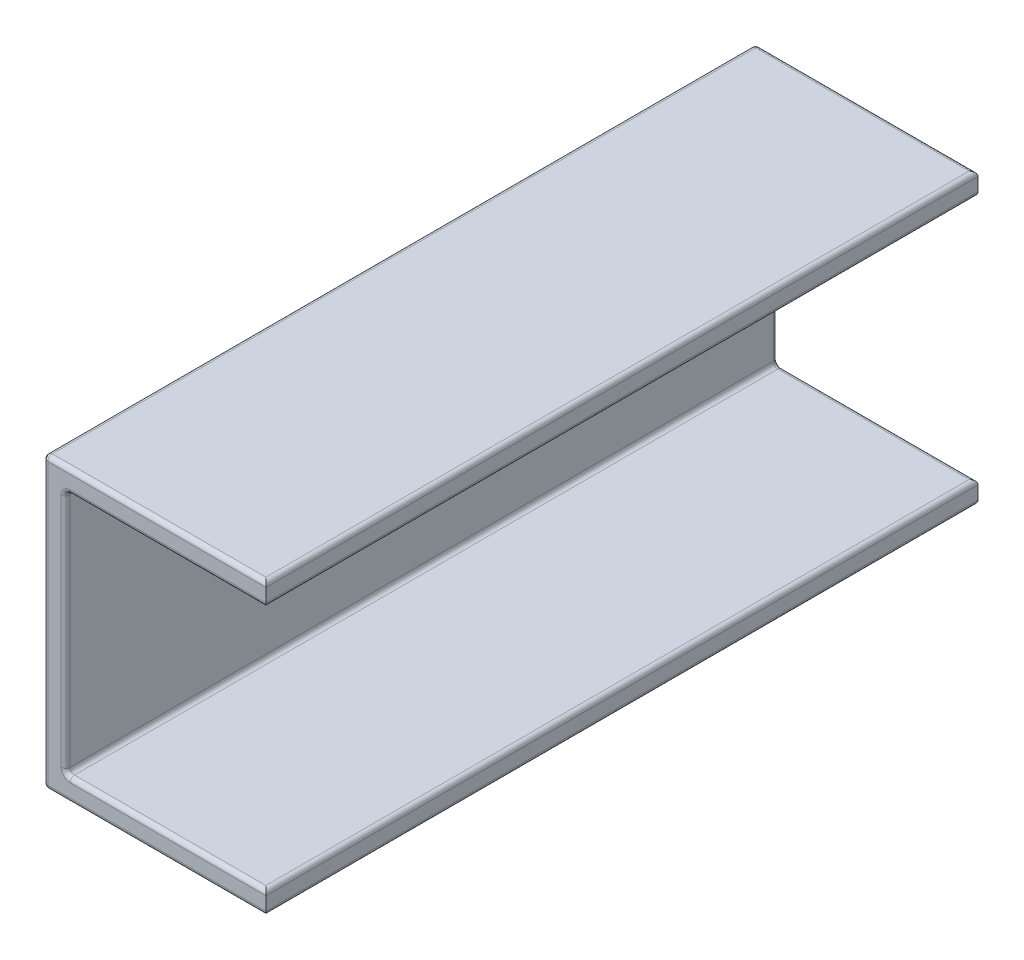
ISO-10303-21;
HEADER;
FILE_DESCRIPTION(('STEP AP214'),'2;1');
FILE_NAME('part.step','',(''),(''),'','','');
FILE_SCHEMA(('AUTOMOTIVE_DESIGN { 1 0 10303 214 1 1 1 1 }'));
ENDSEC;
DATA;
#1=APPLICATION_CONTEXT('core data for automotive mechanical design processes');
#2=APPLICATION_PROTOCOL_DEFINITION('international standard','automotive_design',2000,#1);
#3=PRODUCT_CONTEXT('',#1,'mechanical');
#4=PRODUCT('Part','Part','',(#3));
#5=PRODUCT_RELATED_PRODUCT_CATEGORY('part','',(#4));
#6=PRODUCT_DEFINITION_FORMATION('','',#4);
#7=PRODUCT_DEFINITION_CONTEXT('part definition',#1,'design');
#8=PRODUCT_DEFINITION('design','',#6,#7);
#9=PRODUCT_DEFINITION_SHAPE('','',#8);
#10=(LENGTH_UNIT() NAMED_UNIT(*) SI_UNIT(.MILLI.,.METRE.));
#11=(NAMED_UNIT(*) PLANE_ANGLE_UNIT() SI_UNIT($,.RADIAN.));
#12=(NAMED_UNIT(*) SI_UNIT($,.STERADIAN.) SOLID_ANGLE_UNIT());
#13=UNCERTAINTY_MEASURE_WITH_UNIT(LENGTH_MEASURE(1.E-05),#10,'distance_accuracy_value','');
#14=(GEOMETRIC_REPRESENTATION_CONTEXT(3) GLOBAL_UNCERTAINTY_ASSIGNED_CONTEXT((#13)) GLOBAL_UNIT_ASSIGNED_CONTEXT((#10,
#11,#12)) REPRESENTATION_CONTEXT('',''));
#15=CARTESIAN_POINT('',(0.,0.,0.));
#16=DIRECTION('',(0.,0.,1.));
#17=DIRECTION('',(1.,0.,0.));
#18=AXIS2_PLACEMENT_3D('',#15,#16,#17);
#19=CARTESIAN_POINT('',(-0.136666672173,0.05,0.));
#20=DIRECTION('',(1.,0.,0.));
#21=DIRECTION('',(0.,1.,0.));
#22=AXIS2_PLACEMENT_3D('',#19,#20,#21);
#23=PLANE('',#22);
#24=DIRECTION('',(0.,1.,0.));
#25=VECTOR('',#24,1.);
#26=CARTESIAN_POINT('',(-0.136666672173,0.05,1.59));
#27=LINE('',#26,#25);
#28=CARTESIAN_POINT('',(-0.136666672173,0.59,1.59));
#29=VERTEX_POINT('',#28);
#30=CARTESIAN_POINT('',(-0.136666672173,0.06,1.59));
#31=VERTEX_POINT('',#30);
#32=EDGE_CURVE('E234',#29,#31,#27,.F.);
#33=ORIENTED_EDGE('',*,*,#32,.T.);
#34=DIRECTION('',(0.,0.,1.));
#35=VECTOR('',#34,1.);
#36=CARTESIAN_POINT('',(-0.136666672173,0.06,0.));
#37=LINE('',#36,#35);
#38=CARTESIAN_POINT('',(-0.136666672173,0.06,0.01));
#39=VERTEX_POINT('',#38);
#40=EDGE_CURVE('E227',#31,#39,#37,.F.);
#41=ORIENTED_EDGE('',*,*,#40,.T.);
#42=DIRECTION('',(0.,1.,0.));
#43=VECTOR('',#42,1.);
#44=CARTESIAN_POINT('',(-0.136666672173,0.05,0.01));
#45=LINE('',#44,#43);
#46=CARTESIAN_POINT('',(-0.136666672173,0.59,0.01));
#47=VERTEX_POINT('',#46);
#48=EDGE_CURVE('E237',#39,#47,#45,.T.);
#49=ORIENTED_EDGE('',*,*,#48,.T.);
#50=DIRECTION('',(0.,0.,1.));
#51=VECTOR('',#50,1.);
#52=CARTESIAN_POINT('',(-0.136666672173,0.59,0.));
#53=LINE('',#52,#51);
#54=EDGE_CURVE('E207',#47,#29,#53,.T.);
#55=ORIENTED_EDGE('',*,*,#54,.T.);
#56=EDGE_LOOP('',(#33,#41,#49,#55));
#57=FACE_BOUND('',#56,.T.);
#58=ADVANCED_FACE('F17',(#57),#23,.T.);
#59=CARTESIAN_POINT('',(-0.126666672173,0.06,0.));
#60=DIRECTION('',(0.,0.,1.));
#61=DIRECTION('',(1.,0.,0.));
#62=AXIS2_PLACEMENT_3D('',#59,#60,#61);
#63=CYLINDRICAL_SURFACE('',#62,0.01);
#64=DIRECTION('',(0.,0.,1.));
#65=VECTOR('',#64,1.);
#66=CARTESIAN_POINT('',(-0.126666672173,0.0499999999999997,0.));
#67=LINE('',#66,#65);
#68=CARTESIAN_POINT('',(-0.126666672173,0.0499999999999998,0.01));
#69=VERTEX_POINT('',#68);
#70=CARTESIAN_POINT('',(-0.126666672173,0.0499999999999999,1.59));
#71=VERTEX_POINT('',#70);
#72=EDGE_CURVE('E194',#69,#71,#67,.T.);
#73=ORIENTED_EDGE('',*,*,#72,.F.);
#74=CARTESIAN_POINT('',(-0.126666672173,0.06,0.01));
#75=DIRECTION('',(0.,0.,1.));
#76=DIRECTION('',(1.,0.,0.));
#77=AXIS2_PLACEMENT_3D('',#74,#75,#76);
#78=CIRCLE('',#77,0.01);
#79=EDGE_CURVE('E222',#39,#69,#78,.T.);
#80=ORIENTED_EDGE('',*,*,#79,.F.);
#81=ORIENTED_EDGE('',*,*,#40,.F.);
#82=CARTESIAN_POINT('',(-0.126666672173,0.06,1.59));
#83=DIRECTION('',(0.,0.,1.));
#84=DIRECTION('',(1.,0.,0.));
#85=AXIS2_PLACEMENT_3D('',#82,#83,#84);
#86=CIRCLE('',#85,0.01);
#87=EDGE_CURVE('E213',#71,#31,#86,.F.);
#88=ORIENTED_EDGE('',*,*,#87,.F.);
#89=EDGE_LOOP('',(#73,#80,#81,#88));
#90=FACE_BOUND('',#89,.T.);
#91=ADVANCED_FACE('F633',(#90),#63,.F.);
#92=CARTESIAN_POINT('',(-0.126666672173,0.59,0.));
#93=DIRECTION('',(0.,0.,1.));
#94=DIRECTION('',(1.,0.,0.));
#95=AXIS2_PLACEMENT_3D('',#92,#93,#94);
#96=CYLINDRICAL_SURFACE('',#95,0.01);
#97=ORIENTED_EDGE('',*,*,#54,.F.);
#98=CARTESIAN_POINT('',(-0.126666672173,0.59,0.01));
#99=DIRECTION('',(0.,0.,1.));
#100=DIRECTION('',(1.,0.,0.));
#101=AXIS2_PLACEMENT_3D('',#98,#99,#100);
#102=CIRCLE('',#101,0.01);
#103=CARTESIAN_POINT('',(-0.126666672173,0.6,0.01));
#104=VERTEX_POINT('',#103);
#105=EDGE_CURVE('E210',#104,#47,#102,.T.);
#106=ORIENTED_EDGE('',*,*,#105,.F.);
#107=DIRECTION('',(0.,0.,1.));
#108=VECTOR('',#107,1.);
#109=CARTESIAN_POINT('',(-0.126666672173,0.6,0.));
#110=LINE('',#109,#108);
#111=CARTESIAN_POINT('',(-0.126666672173,0.6,1.59));
#112=VERTEX_POINT('',#111);
#113=EDGE_CURVE('E139',#112,#104,#110,.F.);
#114=ORIENTED_EDGE('',*,*,#113,.F.);
#115=CARTESIAN_POINT('',(-0.126666672173,0.59,1.59));
#116=DIRECTION('',(0.,0.,1.));
#117=DIRECTION('',(1.,0.,0.));
#118=AXIS2_PLACEMENT_3D('',#115,#116,#117);
#119=CIRCLE('',#118,0.01);
#120=EDGE_CURVE('E195',#29,#112,#119,.F.);
#121=ORIENTED_EDGE('',*,*,#120,.F.);
#122=EDGE_LOOP('',(#97,#106,#114,#121));
#123=FACE_BOUND('',#122,.T.);
#124=ADVANCED_FACE('F689',(#123),#96,.F.);
#125=CARTESIAN_POINT('',(0.313333327827,0.05,0.));
#126=DIRECTION('',(0.,1.,0.));
#127=DIRECTION('',(-1.,0.,0.));
#128=AXIS2_PLACEMENT_3D('',#125,#126,#127);
#129=PLANE('',#128);
#130=DIRECTION('',(-1.,0.,0.));
#131=VECTOR('',#130,1.);
#132=CARTESIAN_POINT('',(0.313333327827,0.05,1.59));
#133=LINE('',#132,#131);
#134=CARTESIAN_POINT('',(0.303333327827,0.05,1.59));
#135=VERTEX_POINT('',#134);
#136=EDGE_CURVE('E190',#71,#135,#133,.F.);
#137=ORIENTED_EDGE('',*,*,#136,.T.);
#138=DIRECTION('',(0.,0.,1.));
#139=VECTOR('',#138,1.);
#140=CARTESIAN_POINT('',(0.303333327827,0.05,0.));
#141=LINE('',#140,#139);
#142=CARTESIAN_POINT('',(0.303333327827,0.05,0.01));
#143=VERTEX_POINT('',#142);
#144=EDGE_CURVE('E138',#143,#135,#141,.T.);
#145=ORIENTED_EDGE('',*,*,#144,.F.);
#146=DIRECTION('',(-1.,0.,0.));
#147=VECTOR('',#146,1.);
#148=CARTESIAN_POINT('',(0.313333327827,0.05,0.01));
#149=LINE('',#148,#147);
#150=EDGE_CURVE('E134',#143,#69,#149,.T.);
#151=ORIENTED_EDGE('',*,*,#150,.T.);
#152=ORIENTED_EDGE('',*,*,#72,.T.);
#153=EDGE_LOOP('',(#137,#145,#151,#152));
#154=FACE_BOUND('',#153,.T.);
#155=ADVANCED_FACE('F636',(#154),#129,.T.);
#156=CARTESIAN_POINT('',(-0.136666672173,0.6,0.));
#157=DIRECTION('',(0.,-1.,0.));
#158=DIRECTION('',(1.,0.,0.));
#159=AXIS2_PLACEMENT_3D('',#156,#157,#158);
#160=PLANE('',#159);
#161=DIRECTION('',(1.,0.,0.));
#162=VECTOR('',#161,1.);
#163=CARTESIAN_POINT('',(-0.136666672173,0.6,1.59));
#164=LINE('',#163,#162);
#165=CARTESIAN_POINT('',(0.303333327827,0.6,1.59));
#166=VERTEX_POINT('',#165);
#167=EDGE_CURVE('E183',#166,#112,#164,.F.);
#168=ORIENTED_EDGE('',*,*,#167,.T.);
#169=ORIENTED_EDGE('',*,*,#113,.T.);
#170=DIRECTION('',(1.,0.,0.));
#171=VECTOR('',#170,1.);
#172=CARTESIAN_POINT('',(-0.136666672173,0.6,0.01));
#173=LINE('',#172,#171);
#174=CARTESIAN_POINT('',(0.303333327827,0.6,0.01));
#175=VERTEX_POINT('',#174);
#176=EDGE_CURVE('E186',#104,#175,#173,.T.);
#177=ORIENTED_EDGE('',*,*,#176,.T.);
#178=DIRECTION('',(0.,0.,1.));
#179=VECTOR('',#178,1.);
#180=CARTESIAN_POINT('',(0.303333327827,0.6,0.));
#181=LINE('',#180,#179);
#182=EDGE_CURVE('E178',#166,#175,#181,.F.);
#183=ORIENTED_EDGE('',*,*,#182,.F.);
#184=EDGE_LOOP('',(#168,#169,#177,#183));
#185=FACE_BOUND('',#184,.T.);
#186=ADVANCED_FACE('F691',(#185),#160,.T.);
#187=CARTESIAN_POINT('',(0.303333327827,0.04,0.));
#188=DIRECTION('',(0.,0.,1.));
#189=DIRECTION('',(1.,0.,0.));
#190=AXIS2_PLACEMENT_3D('',#187,#188,#189);
#191=CYLINDRICAL_SURFACE('',#190,0.01);
#192=ORIENTED_EDGE('',*,*,#144,.T.);
#193=CARTESIAN_POINT('',(0.303333327827,0.04,1.59));
#194=DIRECTION('',(-0.707106781186547,0.,0.707106781186547));
#195=DIRECTION('',(0.707106781186547,0.,0.707106781186547));
#196=AXIS2_PLACEMENT_3D('',#193,#194,#195);
#197=ELLIPSE('',#196,0.014142135623731,0.01);
#198=CARTESIAN_POINT('',(0.313333327827,0.04,1.6));
#199=VERTEX_POINT('',#198);
#200=EDGE_CURVE('E144',#135,#199,#197,.F.);
#201=ORIENTED_EDGE('',*,*,#200,.T.);
#202=DIRECTION('',(0.,0.,-1.));
#203=VECTOR('',#202,1.);
#204=CARTESIAN_POINT('',(0.313333327827,0.04,0.));
#205=LINE('',#204,#203);
#206=CARTESIAN_POINT('',(0.313333327827,0.04,0.));
#207=VERTEX_POINT('',#206);
#208=EDGE_CURVE('E141',#207,#199,#205,.F.);
#209=ORIENTED_EDGE('',*,*,#208,.F.);
#210=CARTESIAN_POINT('',(0.303333327827,0.04,0.01));
#211=DIRECTION('',(0.707106781186547,0.,0.707106781186547));
#212=DIRECTION('',(-0.707106781186547,0.,0.707106781186547));
#213=AXIS2_PLACEMENT_3D('',#210,#211,#212);
#214=ELLIPSE('',#213,0.014142135623731,0.01);
#215=EDGE_CURVE('E20',#207,#143,#214,.T.);
#216=ORIENTED_EDGE('',*,*,#215,.T.);
#217=EDGE_LOOP('',(#192,#201,#209,#216));
#218=FACE_BOUND('',#217,.T.);
#219=ADVANCED_FACE('F142',(#218),#191,.T.);
#220=CARTESIAN_POINT('',(0.303333327827,0.61,0.));
#221=DIRECTION('',(0.,0.,1.));
#222=DIRECTION('',(1.,0.,0.));
#223=AXIS2_PLACEMENT_3D('',#220,#221,#222);
#224=CYLINDRICAL_SURFACE('',#223,0.01);
#225=DIRECTION('',(0.,0.,1.));
#226=VECTOR('',#225,1.);
#227=CARTESIAN_POINT('',(0.313333327827,0.61,0.));
#228=LINE('',#227,#226);
#229=CARTESIAN_POINT('',(0.313333327827,0.61,1.6));
#230=VERTEX_POINT('',#229);
#231=CARTESIAN_POINT('',(0.313333327827,0.61,0.));
#232=VERTEX_POINT('',#231);
#233=EDGE_CURVE('E169',#230,#232,#228,.F.);
#234=ORIENTED_EDGE('',*,*,#233,.F.);
#235=CARTESIAN_POINT('',(0.303333327827,0.61,1.59));
#236=DIRECTION('',(-0.707106781186547,0.,0.707106781186547));
#237=DIRECTION('',(0.707106781186547,0.,0.707106781186547));
#238=AXIS2_PLACEMENT_3D('',#235,#236,#237);
#239=ELLIPSE('',#238,0.014142135623731,0.01);
#240=EDGE_CURVE('E149',#230,#166,#239,.F.);
#241=ORIENTED_EDGE('',*,*,#240,.T.);
#242=ORIENTED_EDGE('',*,*,#182,.T.);
#243=CARTESIAN_POINT('',(0.303333327827,0.61,0.01));
#244=DIRECTION('',(0.707106781186547,0.,0.707106781186547));
#245=DIRECTION('',(-0.707106781186547,0.,0.707106781186547));
#246=AXIS2_PLACEMENT_3D('',#243,#244,#245);
#247=ELLIPSE('',#246,0.014142135623731,0.01);
#248=EDGE_CURVE('E180',#175,#232,#247,.T.);
#249=ORIENTED_EDGE('',*,*,#248,.T.);
#250=EDGE_LOOP('',(#234,#241,#242,#249));
#251=FACE_BOUND('',#250,.T.);
#252=ADVANCED_FACE('F313',(#251),#224,.T.);
#253=CARTESIAN_POINT('',(0.313333327827,0.,0.));
#254=DIRECTION('',(1.,0.,0.));
#255=DIRECTION('',(0.,0.,-1.));
#256=AXIS2_PLACEMENT_3D('',#253,#254,#255);
#257=PLANE('',#256);
#258=DIRECTION('',(0.,0.,1.));
#259=VECTOR('',#258,1.);
#260=CARTESIAN_POINT('',(0.313333327827,0.01,0.));
#261=LINE('',#260,#259);
#262=CARTESIAN_POINT('',(0.313333327827,0.0100000000000001,0.));
#263=VERTEX_POINT('',#262);
#264=CARTESIAN_POINT('',(0.313333327827,0.0100000000000001,1.6));
#265=VERTEX_POINT('',#264);
#266=EDGE_CURVE('E167',#263,#265,#261,.T.);
#267=ORIENTED_EDGE('',*,*,#266,.F.);
#268=DIRECTION('',(0.,1.,0.));
#269=VECTOR('',#268,1.);
#270=CARTESIAN_POINT('',(0.313333327827,0.,0.));
#271=LINE('',#270,#269);
#272=EDGE_CURVE('E156',#263,#207,#271,.T.);
#273=ORIENTED_EDGE('',*,*,#272,.T.);
#274=ORIENTED_EDGE('',*,*,#208,.T.);
#275=DIRECTION('',(0.,1.,0.));
#276=VECTOR('',#275,1.);
#277=CARTESIAN_POINT('',(0.313333327827,0.,1.6));
#278=LINE('',#277,#276);
#279=EDGE_CURVE('E148',#199,#265,#278,.F.);
#280=ORIENTED_EDGE('',*,*,#279,.T.);
#281=EDGE_LOOP('',(#267,#273,#274,#280));
#282=FACE_BOUND('',#281,.T.);
#283=ADVANCED_FACE('F165',(#282),#257,.T.);
#284=CARTESIAN_POINT('',(0.313333327827,0.6,0.));
#285=DIRECTION('',(1.,0.,0.));
#286=DIRECTION('',(0.,1.,0.));
#287=AXIS2_PLACEMENT_3D('',#284,#285,#286);
#288=PLANE('',#287);
#289=DIRECTION('',(0.,0.,1.));
#290=VECTOR('',#289,1.);
#291=CARTESIAN_POINT('',(0.313333327827,0.64,0.));
#292=LINE('',#291,#290);
#293=CARTESIAN_POINT('',(0.313333327827,0.64,1.6));
#294=VERTEX_POINT('',#293);
#295=CARTESIAN_POINT('',(0.313333327827,0.64,0.));
#296=VERTEX_POINT('',#295);
#297=EDGE_CURVE('E299',#294,#296,#292,.F.);
#298=ORIENTED_EDGE('',*,*,#297,.F.);
#299=DIRECTION('',(0.,1.,0.));
#300=VECTOR('',#299,1.);
#301=CARTESIAN_POINT('',(0.313333327827,0.6,1.6));
#302=LINE('',#301,#300);
#303=EDGE_CURVE('E326',#294,#230,#302,.F.);
#304=ORIENTED_EDGE('',*,*,#303,.T.);
#305=ORIENTED_EDGE('',*,*,#233,.T.);
#306=DIRECTION('',(0.,1.,0.));
#307=VECTOR('',#306,1.);
#308=CARTESIAN_POINT('',(0.313333327827,0.6,0.));
#309=LINE('',#308,#307);
#310=EDGE_CURVE('E172',#232,#296,#309,.T.);
#311=ORIENTED_EDGE('',*,*,#310,.T.);
#312=EDGE_LOOP('',(#298,#304,#305,#311));
#313=FACE_BOUND('',#312,.T.);
#314=ADVANCED_FACE('F333',(#313),#288,.T.);
#315=CARTESIAN_POINT('',(0.153177077827,0.04,0.01));
#316=DIRECTION('',(-1.,0.,0.));
#317=DIRECTION('',(0.,-1.,0.));
#318=AXIS2_PLACEMENT_3D('',#315,#316,#317);
#319=CYLINDRICAL_SURFACE('',#318,0.01);
#320=ORIENTED_EDGE('',*,*,#150,.F.);
#321=ORIENTED_EDGE('',*,*,#215,.F.);
#322=DIRECTION('',(1.,0.,0.));
#323=VECTOR('',#322,1.);
#324=CARTESIAN_POINT('',(-0.006979172172787,0.04,0.));
#325=LINE('',#324,#323);
#326=CARTESIAN_POINT('',(-0.126666672173,0.04,0.));
#327=VERTEX_POINT('',#326);
#328=EDGE_CURVE('E131',#207,#327,#325,.F.);
#329=ORIENTED_EDGE('',*,*,#328,.T.);
#330=CARTESIAN_POINT('',(-0.126666672173,0.04,0.01));
#331=DIRECTION('',(1.,0.,0.));
#332=DIRECTION('',(0.,-1.,0.));
#333=AXIS2_PLACEMENT_3D('',#330,#331,#332);
#334=CIRCLE('',#333,0.01);
#335=EDGE_CURVE('E337',#69,#327,#334,.F.);
#336=ORIENTED_EDGE('',*,*,#335,.F.);
#337=EDGE_LOOP('',(#320,#321,#329,#336));
#338=FACE_BOUND('',#337,.T.);
#339=ADVANCED_FACE('F128',(#338),#319,.T.);
#340=CARTESIAN_POINT('',(-0.126666672173,0.06,0.01));
#341=DIRECTION('',(0.,0.,1.));
#342=DIRECTION('',(1.,0.,0.));
#343=AXIS2_PLACEMENT_3D('',#340,#341,#342);
#344=TOROIDAL_SURFACE('',#343,0.02,0.01);
#345=CARTESIAN_POINT('',(-0.126666672173,0.06,0.));
#346=DIRECTION('',(0.,0.,-1.));
#347=DIRECTION('',(0.,-1.,0.));
#348=AXIS2_PLACEMENT_3D('',#345,#346,#347);
#349=CIRCLE('',#348,0.02);
#350=CARTESIAN_POINT('',(-0.146666672173,0.06,0.));
#351=VERTEX_POINT('',#350);
#352=EDGE_CURVE('E160',#327,#351,#349,.T.);
#353=ORIENTED_EDGE('',*,*,#352,.T.);
#354=CARTESIAN_POINT('',(-0.146666672173,0.06,0.01));
#355=DIRECTION('',(0.,1.,0.));
#356=DIRECTION('',(-1.,0.,0.));
#357=AXIS2_PLACEMENT_3D('',#354,#355,#356);
#358=CIRCLE('',#357,0.01);
#359=EDGE_CURVE('E338',#39,#351,#358,.T.);
#360=ORIENTED_EDGE('',*,*,#359,.F.);
#361=ORIENTED_EDGE('',*,*,#79,.T.);
#362=ORIENTED_EDGE('',*,*,#335,.T.);
#363=EDGE_LOOP('',(#353,#360,#361,#362));
#364=FACE_BOUND('',#363,.T.);
#365=ADVANCED_FACE('F348',(#364),#344,.T.);
#366=CARTESIAN_POINT('',(-0.146666672173,0.1875,0.01));
#367=DIRECTION('',(0.,1.,0.));
#368=DIRECTION('',(-1.,0.,0.));
#369=AXIS2_PLACEMENT_3D('',#366,#367,#368);
#370=CYLINDRICAL_SURFACE('',#369,0.01);
#371=ORIENTED_EDGE('',*,*,#359,.T.);
#372=DIRECTION('',(0.,1.,0.));
#373=VECTOR('',#372,1.);
#374=CARTESIAN_POINT('',(-0.146666672173,0.325,0.));
#375=LINE('',#374,#373);
#376=CARTESIAN_POINT('',(-0.146666672173,0.59,0.));
#377=VERTEX_POINT('',#376);
#378=EDGE_CURVE('E471',#351,#377,#375,.T.);
#379=ORIENTED_EDGE('',*,*,#378,.T.);
#380=CARTESIAN_POINT('',(-0.146666672173,0.59,0.01));
#381=DIRECTION('',(0.,-1.,0.));
#382=DIRECTION('',(-1.,0.,0.));
#383=AXIS2_PLACEMENT_3D('',#380,#381,#382);
#384=CIRCLE('',#383,0.01);
#385=EDGE_CURVE('E368',#47,#377,#384,.F.);
#386=ORIENTED_EDGE('',*,*,#385,.F.);
#387=ORIENTED_EDGE('',*,*,#48,.F.);
#388=EDGE_LOOP('',(#371,#379,#386,#387));
#389=FACE_BOUND('',#388,.T.);
#390=ADVANCED_FACE('F358',(#389),#370,.T.);
#391=CARTESIAN_POINT('',(-0.126666672173,0.59,0.01));
#392=DIRECTION('',(0.,0.,1.));
#393=DIRECTION('',(1.,0.,0.));
#394=AXIS2_PLACEMENT_3D('',#391,#392,#393);
#395=TOROIDAL_SURFACE('',#394,0.02,0.01);
#396=CARTESIAN_POINT('',(-0.126666672173,0.59,0.));
#397=DIRECTION('',(0.,0.,-1.));
#398=DIRECTION('',(-1.,0.,0.));
#399=AXIS2_PLACEMENT_3D('',#396,#397,#398);
#400=CIRCLE('',#399,0.02);
#401=CARTESIAN_POINT('',(-0.126666672173,0.61,0.));
#402=VERTEX_POINT('',#401);
#403=EDGE_CURVE('E330',#377,#402,#400,.T.);
#404=ORIENTED_EDGE('',*,*,#403,.T.);
#405=CARTESIAN_POINT('',(-0.126666672173,0.61,0.01));
#406=DIRECTION('',(1.,0.,0.));
#407=DIRECTION('',(0.,1.,0.));
#408=AXIS2_PLACEMENT_3D('',#405,#406,#407);
#409=CIRCLE('',#408,0.01);
#410=EDGE_CURVE('E306',#104,#402,#409,.T.);
#411=ORIENTED_EDGE('',*,*,#410,.F.);
#412=ORIENTED_EDGE('',*,*,#105,.T.);
#413=ORIENTED_EDGE('',*,*,#385,.T.);
#414=EDGE_LOOP('',(#404,#411,#412,#413));
#415=FACE_BOUND('',#414,.T.);
#416=ADVANCED_FACE('F378',(#415),#395,.T.);
#417=CARTESIAN_POINT('',(-0.07182292217279,0.61,0.01));
#418=DIRECTION('',(1.,0.,0.));
#419=DIRECTION('',(0.,1.,0.));
#420=AXIS2_PLACEMENT_3D('',#417,#418,#419);
#421=CYLINDRICAL_SURFACE('',#420,0.01);
#422=DIRECTION('',(1.,0.,0.));
#423=VECTOR('',#422,1.);
#424=CARTESIAN_POINT('',(-0.006979172172787,0.61,0.));
#425=LINE('',#424,#423);
#426=EDGE_CURVE('E291',#402,#232,#425,.T.);
#427=ORIENTED_EDGE('',*,*,#426,.T.);
#428=ORIENTED_EDGE('',*,*,#248,.F.);
#429=ORIENTED_EDGE('',*,*,#176,.F.);
#430=ORIENTED_EDGE('',*,*,#410,.T.);
#431=EDGE_LOOP('',(#427,#428,#429,#430));
#432=FACE_BOUND('',#431,.T.);
#433=ADVANCED_FACE('F328',(#432),#421,.T.);
#434=CARTESIAN_POINT('',(-0.09682292217279,0.01,0.01));
#435=DIRECTION('',(1.,0.,0.));
#436=DIRECTION('',(0.,1.,0.));
#437=AXIS2_PLACEMENT_3D('',#434,#435,#436);
#438=CYLINDRICAL_SURFACE('',#437,0.01);
#439=DIRECTION('',(1.,0.,0.));
#440=VECTOR('',#439,1.);
#441=CARTESIAN_POINT('',(-0.006979172172787,0.01,0.));
#442=LINE('',#441,#440);
#443=CARTESIAN_POINT('',(-0.176666672173,0.00999999999999999,0.));
#444=VERTEX_POINT('',#443);
#445=EDGE_CURVE('E162',#444,#263,#442,.T.);
#446=ORIENTED_EDGE('',*,*,#445,.T.);
#447=CARTESIAN_POINT('',(0.303333327827,0.0100000000000001,0.01));
#448=DIRECTION('',(0.707106781186547,0.,0.707106781186547));
#449=DIRECTION('',(-0.707106781186547,0.,0.707106781186547));
#450=AXIS2_PLACEMENT_3D('',#447,#448,#449);
#451=ELLIPSE('',#450,0.014142135623731,0.01);
#452=CARTESIAN_POINT('',(0.303333327827,0.,0.01));
#453=VERTEX_POINT('',#452);
#454=EDGE_CURVE('E304',#453,#263,#451,.T.);
#455=ORIENTED_EDGE('',*,*,#454,.F.);
#456=DIRECTION('',(1.,0.,0.));
#457=VECTOR('',#456,1.);
#458=CARTESIAN_POINT('',(-0.186666672173,0.,0.01));
#459=LINE('',#458,#457);
#460=CARTESIAN_POINT('',(-0.176666672173,0.,0.01));
#461=VERTEX_POINT('',#460);
#462=EDGE_CURVE('E290',#461,#453,#459,.T.);
#463=ORIENTED_EDGE('',*,*,#462,.F.);
#464=CARTESIAN_POINT('',(-0.176666672173,0.00999999999999996,0.01));
#465=DIRECTION('',(1.,0.,0.));
#466=DIRECTION('',(0.,1.,0.));
#467=AXIS2_PLACEMENT_3D('',#464,#465,#466);
#468=CIRCLE('',#467,0.01);
#469=EDGE_CURVE('E287',#444,#461,#468,.F.);
#470=ORIENTED_EDGE('',*,*,#469,.F.);
#471=EDGE_LOOP('',(#446,#455,#463,#470));
#472=FACE_BOUND('',#471,.T.);
#473=ADVANCED_FACE('F797',(#472),#438,.T.);
#474=CARTESIAN_POINT('',(0.303333327827,0.01,0.));
#475=DIRECTION('',(0.,0.,1.));
#476=DIRECTION('',(1.,0.,0.));
#477=AXIS2_PLACEMENT_3D('',#474,#475,#476);
#478=CYLINDRICAL_SURFACE('',#477,0.01);
#479=ORIENTED_EDGE('',*,*,#266,.T.);
#480=CARTESIAN_POINT('',(0.303333327827,0.0100000000000001,1.59));
#481=DIRECTION('',(0.707106781186547,0.,-0.707106781186547));
#482=DIRECTION('',(0.707106781186547,0.,0.707106781186547));
#483=AXIS2_PLACEMENT_3D('',#480,#481,#482);
#484=ELLIPSE('',#483,0.014142135623731,0.01);
#485=CARTESIAN_POINT('',(0.303333327827,0.,1.59));
#486=VERTEX_POINT('',#485);
#487=EDGE_CURVE('E300',#486,#265,#484,.F.);
#488=ORIENTED_EDGE('',*,*,#487,.F.);
#489=DIRECTION('',(0.,0.,1.));
#490=VECTOR('',#489,1.);
#491=CARTESIAN_POINT('',(0.303333327827,0.,0.));
#492=LINE('',#491,#490);
#493=EDGE_CURVE('E395',#453,#486,#492,.T.);
#494=ORIENTED_EDGE('',*,*,#493,.F.);
#495=ORIENTED_EDGE('',*,*,#454,.T.);
#496=EDGE_LOOP('',(#479,#488,#494,#495));
#497=FACE_BOUND('',#496,.T.);
#498=ADVANCED_FACE('F805',(#497),#478,.T.);
#499=CARTESIAN_POINT('',(-0.07182292217279,0.61,1.59));
#500=DIRECTION('',(1.,0.,0.));
#501=DIRECTION('',(0.,1.,0.));
#502=AXIS2_PLACEMENT_3D('',#499,#500,#501);
#503=CYLINDRICAL_SURFACE('',#502,0.01);
#504=ORIENTED_EDGE('',*,*,#167,.F.);
#505=ORIENTED_EDGE('',*,*,#240,.F.);
#506=DIRECTION('',(1.,0.,0.));
#507=VECTOR('',#506,1.);
#508=CARTESIAN_POINT('',(-0.006979172172787,0.61,1.6));
#509=LINE('',#508,#507);
#510=CARTESIAN_POINT('',(-0.126666672173,0.61,1.6));
#511=VERTEX_POINT('',#510);
#512=EDGE_CURVE('E285',#511,#230,#509,.T.);
#513=ORIENTED_EDGE('',*,*,#512,.F.);
#514=CARTESIAN_POINT('',(-0.126666672173,0.61,1.59));
#515=DIRECTION('',(1.,0.,0.));
#516=DIRECTION('',(0.,1.,0.));
#517=AXIS2_PLACEMENT_3D('',#514,#515,#516);
#518=CIRCLE('',#517,0.01);
#519=EDGE_CURVE('E435',#112,#511,#518,.F.);
#520=ORIENTED_EDGE('',*,*,#519,.F.);
#521=EDGE_LOOP('',(#504,#505,#513,#520));
#522=FACE_BOUND('',#521,.T.);
#523=ADVANCED_FACE('F687',(#522),#503,.T.);
#524=CARTESIAN_POINT('',(-0.09682292217279,0.01,1.59));
#525=DIRECTION('',(1.,0.,0.));
#526=DIRECTION('',(0.,1.,0.));
#527=AXIS2_PLACEMENT_3D('',#524,#525,#526);
#528=CYLINDRICAL_SURFACE('',#527,0.01);
#529=DIRECTION('',(1.,0.,0.));
#530=VECTOR('',#529,1.);
#531=CARTESIAN_POINT('',(-0.186666672173,0.,1.59));
#532=LINE('',#531,#530);
#533=CARTESIAN_POINT('',(-0.176666672173,0.,1.59));
#534=VERTEX_POINT('',#533);
#535=EDGE_CURVE('E286',#486,#534,#532,.F.);
#536=ORIENTED_EDGE('',*,*,#535,.F.);
#537=ORIENTED_EDGE('',*,*,#487,.T.);
#538=DIRECTION('',(1.,0.,0.));
#539=VECTOR('',#538,1.);
#540=CARTESIAN_POINT('',(-0.006979172172787,0.01,1.6));
#541=LINE('',#540,#539);
#542=CARTESIAN_POINT('',(-0.176666672173,0.00999999999999999,1.6));
#543=VERTEX_POINT('',#542);
#544=EDGE_CURVE('E515',#543,#265,#541,.T.);
#545=ORIENTED_EDGE('',*,*,#544,.F.);
#546=CARTESIAN_POINT('',(-0.176666672173,0.00999999999999996,1.59));
#547=DIRECTION('',(1.,0.,0.));
#548=DIRECTION('',(0.,1.,0.));
#549=AXIS2_PLACEMENT_3D('',#546,#547,#548);
#550=CIRCLE('',#549,0.01);
#551=EDGE_CURVE('E282',#534,#543,#550,.F.);
#552=ORIENTED_EDGE('',*,*,#551,.F.);
#553=EDGE_LOOP('',(#536,#537,#545,#552));
#554=FACE_BOUND('',#553,.T.);
#555=ADVANCED_FACE('F823',(#554),#528,.T.);
#556=CARTESIAN_POINT('',(0.153177077827,0.04,1.59));
#557=DIRECTION('',(-1.,0.,0.));
#558=DIRECTION('',(0.,-1.,0.));
#559=AXIS2_PLACEMENT_3D('',#556,#557,#558);
#560=CYLINDRICAL_SURFACE('',#559,0.01);
#561=DIRECTION('',(1.,0.,0.));
#562=VECTOR('',#561,1.);
#563=CARTESIAN_POINT('',(-0.006979172172787,0.04,1.6));
#564=LINE('',#563,#562);
#565=CARTESIAN_POINT('',(-0.126666672173,0.04,1.6));
#566=VERTEX_POINT('',#565);
#567=EDGE_CURVE('E640',#199,#566,#564,.F.);
#568=ORIENTED_EDGE('',*,*,#567,.F.);
#569=ORIENTED_EDGE('',*,*,#200,.F.);
#570=ORIENTED_EDGE('',*,*,#136,.F.);
#571=CARTESIAN_POINT('',(-0.126666672173,0.04,1.59));
#572=DIRECTION('',(-1.,0.,0.));
#573=DIRECTION('',(0.,-1.,0.));
#574=AXIS2_PLACEMENT_3D('',#571,#572,#573);
#575=CIRCLE('',#574,0.01);
#576=EDGE_CURVE('E303',#566,#71,#575,.T.);
#577=ORIENTED_EDGE('',*,*,#576,.F.);
#578=EDGE_LOOP('',(#568,#569,#570,#577));
#579=FACE_BOUND('',#578,.T.);
#580=ADVANCED_FACE('F420',(#579),#560,.T.);
#581=CARTESIAN_POINT('',(-0.126666672173,0.06,1.59));
#582=DIRECTION('',(0.,0.,-1.));
#583=DIRECTION('',(-1.,0.,0.));
#584=AXIS2_PLACEMENT_3D('',#581,#582,#583);
#585=TOROIDAL_SURFACE('',#584,0.02,0.01);
#586=CARTESIAN_POINT('',(-0.146666672173,0.06,1.59));
#587=DIRECTION('',(0.,1.,0.));
#588=DIRECTION('',(-1.,0.,0.));
#589=AXIS2_PLACEMENT_3D('',#586,#587,#588);
#590=CIRCLE('',#589,0.01);
#591=CARTESIAN_POINT('',(-0.146666672173,0.06,1.6));
#592=VERTEX_POINT('',#591);
#593=EDGE_CURVE('E402',#592,#31,#590,.T.);
#594=ORIENTED_EDGE('',*,*,#593,.F.);
#595=CARTESIAN_POINT('',(-0.126666672173,0.06,1.6));
#596=DIRECTION('',(0.,0.,1.));
#597=DIRECTION('',(-1.,0.,0.));
#598=AXIS2_PLACEMENT_3D('',#595,#596,#597);
#599=CIRCLE('',#598,0.02);
#600=EDGE_CURVE('E642',#566,#592,#599,.F.);
#601=ORIENTED_EDGE('',*,*,#600,.F.);
#602=ORIENTED_EDGE('',*,*,#576,.T.);
#603=ORIENTED_EDGE('',*,*,#87,.T.);
#604=EDGE_LOOP('',(#594,#601,#602,#603));
#605=FACE_BOUND('',#604,.T.);
#606=ADVANCED_FACE('F409',(#605),#585,.T.);
#607=CARTESIAN_POINT('',(-0.146666672173,0.1875,1.59));
#608=DIRECTION('',(0.,1.,0.));
#609=DIRECTION('',(-1.,0.,0.));
#610=AXIS2_PLACEMENT_3D('',#607,#608,#609);
#611=CYLINDRICAL_SURFACE('',#610,0.01);
#612=ORIENTED_EDGE('',*,*,#593,.T.);
#613=ORIENTED_EDGE('',*,*,#32,.F.);
#614=CARTESIAN_POINT('',(-0.146666672173,0.59,1.59));
#615=DIRECTION('',(0.,1.,0.));
#616=DIRECTION('',(-1.,0.,0.));
#617=AXIS2_PLACEMENT_3D('',#614,#615,#616);
#618=CIRCLE('',#617,0.01);
#619=CARTESIAN_POINT('',(-0.146666672173,0.59,1.6));
#620=VERTEX_POINT('',#619);
#621=EDGE_CURVE('E430',#620,#29,#618,.T.);
#622=ORIENTED_EDGE('',*,*,#621,.F.);
#623=DIRECTION('',(0.,1.,0.));
#624=VECTOR('',#623,1.);
#625=CARTESIAN_POINT('',(-0.146666672173,0.325,1.6));
#626=LINE('',#625,#624);
#627=EDGE_CURVE('E644',#592,#620,#626,.T.);
#628=ORIENTED_EDGE('',*,*,#627,.F.);
#629=EDGE_LOOP('',(#612,#613,#622,#628));
#630=FACE_BOUND('',#629,.T.);
#631=ADVANCED_FACE('F419',(#630),#611,.T.);
#632=CARTESIAN_POINT('',(-0.126666672173,0.59,1.59));
#633=DIRECTION('',(0.,0.,-1.));
#634=DIRECTION('',(-1.,0.,0.));
#635=AXIS2_PLACEMENT_3D('',#632,#633,#634);
#636=TOROIDAL_SURFACE('',#635,0.02,0.01);
#637=ORIENTED_EDGE('',*,*,#519,.T.);
#638=CARTESIAN_POINT('',(-0.126666672173,0.59,1.6));
#639=DIRECTION('',(0.,0.,1.));
#640=DIRECTION('',(0.,1.,0.));
#641=AXIS2_PLACEMENT_3D('',#638,#639,#640);
#642=CIRCLE('',#641,0.0199999999999999);
#643=EDGE_CURVE('E281',#620,#511,#642,.F.);
#644=ORIENTED_EDGE('',*,*,#643,.F.);
#645=ORIENTED_EDGE('',*,*,#621,.T.);
#646=ORIENTED_EDGE('',*,*,#120,.T.);
#647=EDGE_LOOP('',(#637,#644,#645,#646));
#648=FACE_BOUND('',#647,.T.);
#649=ADVANCED_FACE('F445',(#648),#636,.T.);
#650=CARTESIAN_POINT('',(0.153177077827,0.64,1.59));
#651=DIRECTION('',(-1.,0.,0.));
#652=DIRECTION('',(0.,-1.,0.));
#653=AXIS2_PLACEMENT_3D('',#650,#651,#652);
#654=CYLINDRICAL_SURFACE('',#653,0.01);
#655=DIRECTION('',(1.,0.,0.));
#656=VECTOR('',#655,1.);
#657=CARTESIAN_POINT('',(-0.006979172172787,0.64,1.6));
#658=LINE('',#657,#656);
#659=CARTESIAN_POINT('',(-0.176666672173,0.64,1.6));
#660=VERTEX_POINT('',#659);
#661=EDGE_CURVE('E646',#294,#660,#658,.F.);
#662=ORIENTED_EDGE('',*,*,#661,.F.);
#663=CARTESIAN_POINT('',(0.303333327827,0.64,1.59));
#664=DIRECTION('',(-0.707106781186547,0.,0.707106781186547));
#665=DIRECTION('',(0.707106781186547,0.,0.707106781186547));
#666=AXIS2_PLACEMENT_3D('',#663,#664,#665);
#667=ELLIPSE('',#666,0.014142135623731,0.01);
#668=CARTESIAN_POINT('',(0.303333327827,0.65,1.59));
#669=VERTEX_POINT('',#668);
#670=EDGE_CURVE('E296',#669,#294,#667,.F.);
#671=ORIENTED_EDGE('',*,*,#670,.F.);
#672=DIRECTION('',(-1.,0.,0.));
#673=VECTOR('',#672,1.);
#674=CARTESIAN_POINT('',(0.313333327827,0.65,1.59));
#675=LINE('',#674,#673);
#676=CARTESIAN_POINT('',(-0.176666672173,0.65,1.59));
#677=VERTEX_POINT('',#676);
#678=EDGE_CURVE('E461',#677,#669,#675,.F.);
#679=ORIENTED_EDGE('',*,*,#678,.F.);
#680=CARTESIAN_POINT('',(-0.176666672173,0.64,1.59));
#681=DIRECTION('',(-1.,0.,0.));
#682=DIRECTION('',(0.,-1.,0.));
#683=AXIS2_PLACEMENT_3D('',#680,#681,#682);
#684=CIRCLE('',#683,0.01);
#685=EDGE_CURVE('E278',#660,#677,#684,.T.);
#686=ORIENTED_EDGE('',*,*,#685,.F.);
#687=EDGE_LOOP('',(#662,#671,#679,#686));
#688=FACE_BOUND('',#687,.T.);
#689=ADVANCED_FACE('F454',(#688),#654,.T.);
#690=CARTESIAN_POINT('',(0.303333327827,0.64,0.));
#691=DIRECTION('',(0.,0.,1.));
#692=DIRECTION('',(1.,0.,0.));
#693=AXIS2_PLACEMENT_3D('',#690,#691,#692);
#694=CYLINDRICAL_SURFACE('',#693,0.01);
#695=DIRECTION('',(0.,0.,1.));
#696=VECTOR('',#695,1.);
#697=CARTESIAN_POINT('',(0.303333327827,0.65,0.));
#698=LINE('',#697,#696);
#699=CARTESIAN_POINT('',(0.303333327827,0.65,0.01));
#700=VERTEX_POINT('',#699);
#701=EDGE_CURVE('E277',#669,#700,#698,.F.);
#702=ORIENTED_EDGE('',*,*,#701,.F.);
#703=ORIENTED_EDGE('',*,*,#670,.T.);
#704=ORIENTED_EDGE('',*,*,#297,.T.);
#705=CARTESIAN_POINT('',(0.303333327827,0.64,0.01));
#706=DIRECTION('',(-0.707106781186547,0.,-0.707106781186547));
#707=DIRECTION('',(-0.707106781186547,0.,0.707106781186547));
#708=AXIS2_PLACEMENT_3D('',#705,#706,#707);
#709=ELLIPSE('',#708,0.014142135623731,0.01);
#710=EDGE_CURVE('E292',#700,#296,#709,.T.);
#711=ORIENTED_EDGE('',*,*,#710,.F.);
#712=EDGE_LOOP('',(#702,#703,#704,#711));
#713=FACE_BOUND('',#712,.T.);
#714=ADVANCED_FACE('F866',(#713),#694,.T.);
#715=CARTESIAN_POINT('',(0.153177077827,0.64,0.01));
#716=DIRECTION('',(-1.,0.,0.));
#717=DIRECTION('',(0.,-1.,0.));
#718=AXIS2_PLACEMENT_3D('',#715,#716,#717);
#719=CYLINDRICAL_SURFACE('',#718,0.01);
#720=DIRECTION('',(-1.,0.,0.));
#721=VECTOR('',#720,1.);
#722=CARTESIAN_POINT('',(0.313333327827,0.65,0.01));
#723=LINE('',#722,#721);
#724=CARTESIAN_POINT('',(-0.176666672173,0.65,0.01));
#725=VERTEX_POINT('',#724);
#726=EDGE_CURVE('E280',#700,#725,#723,.T.);
#727=ORIENTED_EDGE('',*,*,#726,.F.);
#728=ORIENTED_EDGE('',*,*,#710,.T.);
#729=DIRECTION('',(1.,0.,0.));
#730=VECTOR('',#729,1.);
#731=CARTESIAN_POINT('',(-0.006979172172787,0.64,0.));
#732=LINE('',#731,#730);
#733=CARTESIAN_POINT('',(-0.176666672173,0.64,0.));
#734=VERTEX_POINT('',#733);
#735=EDGE_CURVE('E295',#296,#734,#732,.F.);
#736=ORIENTED_EDGE('',*,*,#735,.T.);
#737=CARTESIAN_POINT('',(-0.176666672173,0.64,0.01));
#738=DIRECTION('',(-1.,0.,0.));
#739=DIRECTION('',(0.,-1.,0.));
#740=AXIS2_PLACEMENT_3D('',#737,#738,#739);
#741=CIRCLE('',#740,0.01);
#742=EDGE_CURVE('E274',#725,#734,#741,.T.);
#743=ORIENTED_EDGE('',*,*,#742,.F.);
#744=EDGE_LOOP('',(#727,#728,#736,#743));
#745=FACE_BOUND('',#744,.T.);
#746=ADVANCED_FACE('F491',(#745),#719,.T.);
#747=CARTESIAN_POINT('',(-0.006979172172787,0.325,0.));
#748=DIRECTION('',(0.,0.,1.));
#749=DIRECTION('',(1.,0.,0.));
#750=AXIS2_PLACEMENT_3D('',#747,#748,#749);
#751=PLANE('',#750);
#752=ORIENTED_EDGE('',*,*,#403,.F.);
#753=ORIENTED_EDGE('',*,*,#378,.F.);
#754=ORIENTED_EDGE('',*,*,#352,.F.);
#755=ORIENTED_EDGE('',*,*,#328,.F.);
#756=ORIENTED_EDGE('',*,*,#272,.F.);
#757=ORIENTED_EDGE('',*,*,#445,.F.);
#758=DIRECTION('',(0.,-1.,0.));
#759=VECTOR('',#758,1.);
#760=CARTESIAN_POINT('',(-0.176666672173,0.4875,0.));
#761=LINE('',#760,#759);
#762=EDGE_CURVE('E267',#734,#444,#761,.T.);
#763=ORIENTED_EDGE('',*,*,#762,.F.);
#764=ORIENTED_EDGE('',*,*,#735,.F.);
#765=ORIENTED_EDGE('',*,*,#310,.F.);
#766=ORIENTED_EDGE('',*,*,#426,.F.);
#767=EDGE_LOOP('',(#752,#753,#754,#755,#756,#757,#763,#764,#765,#766));
#768=FACE_BOUND('',#767,.T.);
#769=ADVANCED_FACE('F154',(#768),#751,.F.);
#770=CARTESIAN_POINT('',(-0.176666672173,0.01,0.01));
#771=DIRECTION('',(-0.577350269189626,-0.577350269189626,-0.577350269189626));
#772=DIRECTION('',(-0.707106781186548,0.707106781186548,0.));
#773=AXIS2_PLACEMENT_3D('',#770,#771,#772);
#774=SPHERICAL_SURFACE('',#773,0.01);
#775=CARTESIAN_POINT('',(-0.182440174864896,0.00422649730810374,0.00422649730810374));
#776=VERTEX_POINT('',#775);
#777=VERTEX_LOOP('',#776);
#778=FACE_BOUND('',#777,.T.);
#779=CARTESIAN_POINT('',(-0.176666672173,0.01,0.01));
#780=DIRECTION('',(0.,-1.,0.));
#781=DIRECTION('',(1.,0.,0.));
#782=AXIS2_PLACEMENT_3D('',#779,#780,#781);
#783=CIRCLE('',#782,0.01);
#784=CARTESIAN_POINT('',(-0.186666672173,0.01,0.01));
#785=VERTEX_POINT('',#784);
#786=EDGE_CURVE('E271',#444,#785,#783,.F.);
#787=ORIENTED_EDGE('',*,*,#786,.F.);
#788=ORIENTED_EDGE('',*,*,#469,.T.);
#789=CARTESIAN_POINT('',(-0.176666672173,0.01,0.01));
#790=DIRECTION('',(0.,0.,1.));
#791=DIRECTION('',(1.,0.,0.));
#792=AXIS2_PLACEMENT_3D('',#789,#790,#791);
#793=CIRCLE('',#792,0.01);
#794=EDGE_CURVE('E261',#785,#461,#793,.T.);
#795=ORIENTED_EDGE('',*,*,#794,.F.);
#796=EDGE_LOOP('',(#787,#788,#795));
#797=FACE_BOUND('',#796,.T.);
#798=ADVANCED_FACE('F490',(#778,#797),#774,.T.);
#799=CARTESIAN_POINT('',(-0.186666672173,0.,0.));
#800=DIRECTION('',(0.,-1.,0.));
#801=DIRECTION('',(1.,0.,0.));
#802=AXIS2_PLACEMENT_3D('',#799,#800,#801);
#803=PLANE('',#802);
#804=ORIENTED_EDGE('',*,*,#535,.T.);
#805=DIRECTION('',(0.,0.,1.));
#806=VECTOR('',#805,1.);
#807=CARTESIAN_POINT('',(-0.176666672173,0.,0.));
#808=LINE('',#807,#806);
#809=EDGE_CURVE('E260',#461,#534,#808,.T.);
#810=ORIENTED_EDGE('',*,*,#809,.F.);
#811=ORIENTED_EDGE('',*,*,#462,.T.);
#812=ORIENTED_EDGE('',*,*,#493,.T.);
#813=EDGE_LOOP('',(#804,#810,#811,#812));
#814=FACE_BOUND('',#813,.T.);
#815=ADVANCED_FACE('F522',(#814),#803,.T.);
#816=CARTESIAN_POINT('',(-0.176666672173,0.01,1.59));
#817=DIRECTION('',(-0.577350269189626,-0.577350269189626,0.577350269189626));
#818=DIRECTION('',(-0.707106781186548,0.,-0.707106781186548));
#819=AXIS2_PLACEMENT_3D('',#816,#817,#818);
#820=SPHERICAL_SURFACE('',#819,0.01);
#821=CARTESIAN_POINT('',(-0.182440174864896,0.00422649730810375,1.5957735026919));
#822=VERTEX_POINT('',#821);
#823=VERTEX_LOOP('',#822);
#824=FACE_BOUND('',#823,.T.);
#825=CARTESIAN_POINT('',(-0.176666672173,0.01,1.59));
#826=DIRECTION('',(0.,0.,1.));
#827=DIRECTION('',(1.,0.,0.));
#828=AXIS2_PLACEMENT_3D('',#825,#826,#827);
#829=CIRCLE('',#828,0.01);
#830=CARTESIAN_POINT('',(-0.186666672173,0.01,1.59));
#831=VERTEX_POINT('',#830);
#832=EDGE_CURVE('E264',#534,#831,#829,.F.);
#833=ORIENTED_EDGE('',*,*,#832,.F.);
#834=ORIENTED_EDGE('',*,*,#551,.T.);
#835=CARTESIAN_POINT('',(-0.176666672173,0.01,1.59));
#836=DIRECTION('',(0.,-1.,0.));
#837=DIRECTION('',(1.,0.,0.));
#838=AXIS2_PLACEMENT_3D('',#835,#836,#837);
#839=CIRCLE('',#838,0.01);
#840=EDGE_CURVE('E257',#831,#543,#839,.F.);
#841=ORIENTED_EDGE('',*,*,#840,.F.);
#842=EDGE_LOOP('',(#833,#834,#841));
#843=FACE_BOUND('',#842,.T.);
#844=ADVANCED_FACE('F518',(#824,#843),#820,.T.);
#845=CARTESIAN_POINT('',(-0.006979172172787,0.325,1.6));
#846=DIRECTION('',(0.,0.,1.));
#847=DIRECTION('',(1.,0.,0.));
#848=AXIS2_PLACEMENT_3D('',#845,#846,#847);
#849=PLANE('',#848);
#850=ORIENTED_EDGE('',*,*,#627,.T.);
#851=ORIENTED_EDGE('',*,*,#643,.T.);
#852=ORIENTED_EDGE('',*,*,#512,.T.);
#853=ORIENTED_EDGE('',*,*,#303,.F.);
#854=ORIENTED_EDGE('',*,*,#661,.T.);
#855=DIRECTION('',(0.,-1.,0.));
#856=VECTOR('',#855,1.);
#857=CARTESIAN_POINT('',(-0.176666672173,0.4875,1.6));
#858=LINE('',#857,#856);
#859=EDGE_CURVE('E256',#543,#660,#858,.F.);
#860=ORIENTED_EDGE('',*,*,#859,.F.);
#861=ORIENTED_EDGE('',*,*,#544,.T.);
#862=ORIENTED_EDGE('',*,*,#279,.F.);
#863=ORIENTED_EDGE('',*,*,#567,.T.);
#864=ORIENTED_EDGE('',*,*,#600,.T.);
#865=EDGE_LOOP('',(#850,#851,#852,#853,#854,#860,#861,#862,#863,#864));
#866=FACE_BOUND('',#865,.T.);
#867=ADVANCED_FACE('F521',(#866),#849,.T.);
#868=CARTESIAN_POINT('',(-0.176666672173,0.64,1.59));
#869=DIRECTION('',(-0.577350269189626,0.577350269189626,0.577350269189626));
#870=DIRECTION('',(-0.707106781186548,0.,-0.707106781186548));
#871=AXIS2_PLACEMENT_3D('',#868,#869,#870);
#872=SPHERICAL_SURFACE('',#871,0.01);
#873=CARTESIAN_POINT('',(-0.182440174864896,0.645773502691896,1.5957735026919));
#874=VERTEX_POINT('',#873);
#875=VERTEX_LOOP('',#874);
#876=FACE_BOUND('',#875,.T.);
#877=CARTESIAN_POINT('',(-0.176666672173,0.64,1.59));
#878=DIRECTION('',(0.,0.,1.));
#879=DIRECTION('',(1.,0.,0.));
#880=AXIS2_PLACEMENT_3D('',#877,#878,#879);
#881=CIRCLE('',#880,0.01);
#882=CARTESIAN_POINT('',(-0.186666672173,0.64,1.59));
#883=VERTEX_POINT('',#882);
#884=EDGE_CURVE('E35',#883,#677,#881,.F.);
#885=ORIENTED_EDGE('',*,*,#884,.F.);
#886=CARTESIAN_POINT('',(-0.176666672173,0.64,1.59));
#887=DIRECTION('',(0.,-1.,0.));
#888=DIRECTION('',(1.,0.,0.));
#889=AXIS2_PLACEMENT_3D('',#886,#887,#888);
#890=CIRCLE('',#889,0.01);
#891=EDGE_CURVE('E254',#660,#883,#890,.T.);
#892=ORIENTED_EDGE('',*,*,#891,.F.);
#893=ORIENTED_EDGE('',*,*,#685,.T.);
#894=EDGE_LOOP('',(#885,#892,#893));
#895=FACE_BOUND('',#894,.T.);
#896=ADVANCED_FACE('F576',(#876,#895),#872,.T.);
#897=CARTESIAN_POINT('',(0.313333327827,0.65,0.));
#898=DIRECTION('',(0.,1.,0.));
#899=DIRECTION('',(-1.,0.,0.));
#900=AXIS2_PLACEMENT_3D('',#897,#898,#899);
#901=PLANE('',#900);
#902=ORIENTED_EDGE('',*,*,#678,.T.);
#903=ORIENTED_EDGE('',*,*,#701,.T.);
#904=ORIENTED_EDGE('',*,*,#726,.T.);
#905=DIRECTION('',(0.,0.,1.));
#906=VECTOR('',#905,1.);
#907=CARTESIAN_POINT('',(-0.176666672173,0.65,0.));
#908=LINE('',#907,#906);
#909=EDGE_CURVE('E252',#677,#725,#908,.F.);
#910=ORIENTED_EDGE('',*,*,#909,.F.);
#911=EDGE_LOOP('',(#902,#903,#904,#910));
#912=FACE_BOUND('',#911,.T.);
#913=ADVANCED_FACE('F561',(#912),#901,.T.);
#914=CARTESIAN_POINT('',(-0.176666672173,0.64,0.01));
#915=DIRECTION('',(-0.577350269189626,0.577350269189626,-0.577350269189626));
#916=DIRECTION('',(0.707106781186548,0.,-0.707106781186548));
#917=AXIS2_PLACEMENT_3D('',#914,#915,#916);
#918=SPHERICAL_SURFACE('',#917,0.01);
#919=CARTESIAN_POINT('',(-0.182440174864896,0.645773502691896,0.00422649730810375));
#920=VERTEX_POINT('',#919);
#921=VERTEX_LOOP('',#920);
#922=FACE_BOUND('',#921,.T.);
#923=ORIENTED_EDGE('',*,*,#742,.T.);
#924=CARTESIAN_POINT('',(-0.176666672173,0.64,0.01));
#925=DIRECTION('',(0.,-1.,0.));
#926=DIRECTION('',(1.,0.,0.));
#927=AXIS2_PLACEMENT_3D('',#924,#925,#926);
#928=CIRCLE('',#927,0.01);
#929=CARTESIAN_POINT('',(-0.186666672173,0.64,0.01));
#930=VERTEX_POINT('',#929);
#931=EDGE_CURVE('E268',#930,#734,#928,.T.);
#932=ORIENTED_EDGE('',*,*,#931,.F.);
#933=CARTESIAN_POINT('',(-0.176666672173,0.64,0.01));
#934=DIRECTION('',(0.,0.,1.));
#935=DIRECTION('',(1.,0.,0.));
#936=AXIS2_PLACEMENT_3D('',#933,#934,#935);
#937=CIRCLE('',#936,0.01);
#938=EDGE_CURVE('E248',#725,#930,#937,.T.);
#939=ORIENTED_EDGE('',*,*,#938,.F.);
#940=EDGE_LOOP('',(#923,#932,#939));
#941=FACE_BOUND('',#940,.T.);
#942=ADVANCED_FACE('F556',(#922,#941),#918,.T.);
#943=CARTESIAN_POINT('',(-0.176666672173,0.4875,0.01));
#944=DIRECTION('',(0.,-1.,0.));
#945=DIRECTION('',(1.,0.,0.));
#946=AXIS2_PLACEMENT_3D('',#943,#944,#945);
#947=CYLINDRICAL_SURFACE('',#946,0.01);
#948=ORIENTED_EDGE('',*,*,#931,.T.);
#949=ORIENTED_EDGE('',*,*,#762,.T.);
#950=ORIENTED_EDGE('',*,*,#786,.T.);
#951=DIRECTION('',(0.,-1.,0.));
#952=VECTOR('',#951,1.);
#953=CARTESIAN_POINT('',(-0.186666672173,0.65,0.01));
#954=LINE('',#953,#952);
#955=EDGE_CURVE('E251',#930,#785,#954,.T.);
#956=ORIENTED_EDGE('',*,*,#955,.F.);
#957=EDGE_LOOP('',(#948,#949,#950,#956));
#958=FACE_BOUND('',#957,.T.);
#959=ADVANCED_FACE('F552',(#958),#947,.T.);
#960=CARTESIAN_POINT('',(-0.176666672173,0.01,0.));
#961=DIRECTION('',(0.,0.,1.));
#962=DIRECTION('',(1.,0.,0.));
#963=AXIS2_PLACEMENT_3D('',#960,#961,#962);
#964=CYLINDRICAL_SURFACE('',#963,0.01);
#965=ORIENTED_EDGE('',*,*,#794,.T.);
#966=ORIENTED_EDGE('',*,*,#809,.T.);
#967=ORIENTED_EDGE('',*,*,#832,.T.);
#968=DIRECTION('',(0.,0.,1.));
#969=VECTOR('',#968,1.);
#970=CARTESIAN_POINT('',(-0.186666672173,0.01,0.));
#971=LINE('',#970,#969);
#972=EDGE_CURVE('E510',#785,#831,#971,.T.);
#973=ORIENTED_EDGE('',*,*,#972,.F.);
#974=EDGE_LOOP('',(#965,#966,#967,#973));
#975=FACE_BOUND('',#974,.T.);
#976=ADVANCED_FACE('F548',(#975),#964,.T.);
#977=CARTESIAN_POINT('',(-0.176666672173,0.4875,1.59));
#978=DIRECTION('',(0.,-1.,0.));
#979=DIRECTION('',(1.,0.,0.));
#980=AXIS2_PLACEMENT_3D('',#977,#978,#979);
#981=CYLINDRICAL_SURFACE('',#980,0.01);
#982=ORIENTED_EDGE('',*,*,#891,.T.);
#983=DIRECTION('',(0.,-1.,0.));
#984=VECTOR('',#983,1.);
#985=CARTESIAN_POINT('',(-0.186666672173,0.65,1.59));
#986=LINE('',#985,#984);
#987=EDGE_CURVE('E26',#831,#883,#986,.F.);
#988=ORIENTED_EDGE('',*,*,#987,.F.);
#989=ORIENTED_EDGE('',*,*,#840,.T.);
#990=ORIENTED_EDGE('',*,*,#859,.T.);
#991=EDGE_LOOP('',(#982,#988,#989,#990));
#992=FACE_BOUND('',#991,.T.);
#993=ADVANCED_FACE('F541',(#992),#981,.T.);
#994=CARTESIAN_POINT('',(-0.176666672173,0.64,0.));
#995=DIRECTION('',(0.,0.,1.));
#996=DIRECTION('',(1.,0.,0.));
#997=AXIS2_PLACEMENT_3D('',#994,#995,#996);
#998=CYLINDRICAL_SURFACE('',#997,0.01);
#999=ORIENTED_EDGE('',*,*,#938,.T.);
#1000=DIRECTION('',(0.,0.,1.));
#1001=VECTOR('',#1000,1.);
#1002=CARTESIAN_POINT('',(-0.186666672173,0.64,0.));
#1003=LINE('',#1002,#1001);
#1004=EDGE_CURVE('E11',#883,#930,#1003,.F.);
#1005=ORIENTED_EDGE('',*,*,#1004,.F.);
#1006=ORIENTED_EDGE('',*,*,#884,.T.);
#1007=ORIENTED_EDGE('',*,*,#909,.T.);
#1008=EDGE_LOOP('',(#999,#1005,#1006,#1007));
#1009=FACE_BOUND('',#1008,.T.);
#1010=ADVANCED_FACE('F535',(#1009),#998,.T.);
#1011=CARTESIAN_POINT('',(-0.186666672173,0.65,0.));
#1012=DIRECTION('',(-1.,0.,0.));
#1013=DIRECTION('',(0.,-1.,0.));
#1014=AXIS2_PLACEMENT_3D('',#1011,#1012,#1013);
#1015=PLANE('',#1014);
#1016=ORIENTED_EDGE('',*,*,#987,.T.);
#1017=ORIENTED_EDGE('',*,*,#1004,.T.);
#1018=ORIENTED_EDGE('',*,*,#955,.T.);
#1019=ORIENTED_EDGE('',*,*,#972,.T.);
#1020=EDGE_LOOP('',(#1016,#1017,#1018,#1019));
#1021=FACE_BOUND('',#1020,.T.);
#1022=ADVANCED_FACE('F533',(#1021),#1015,.T.);
#1023=CLOSED_SHELL('',(#58,#91,#124,#155,#186,#219,#252,#283,#314,#339,#365,#390,#416,#433,#473,
#498,#523,#555,#580,#606,#631,#649,#689,#714,#746,#769,#798,#815,#844,#867,#896,#913,#942,#959,
#976,#993,#1010,#1022));
#1024=MANIFOLD_SOLID_BREP('B1',#1023);
#1025=ADVANCED_BREP_SHAPE_REPRESENTATION('',(#18,#1024),#14);
#1026=SHAPE_DEFINITION_REPRESENTATION(#9,#1025);
ENDSEC;
END-ISO-10303-21;
